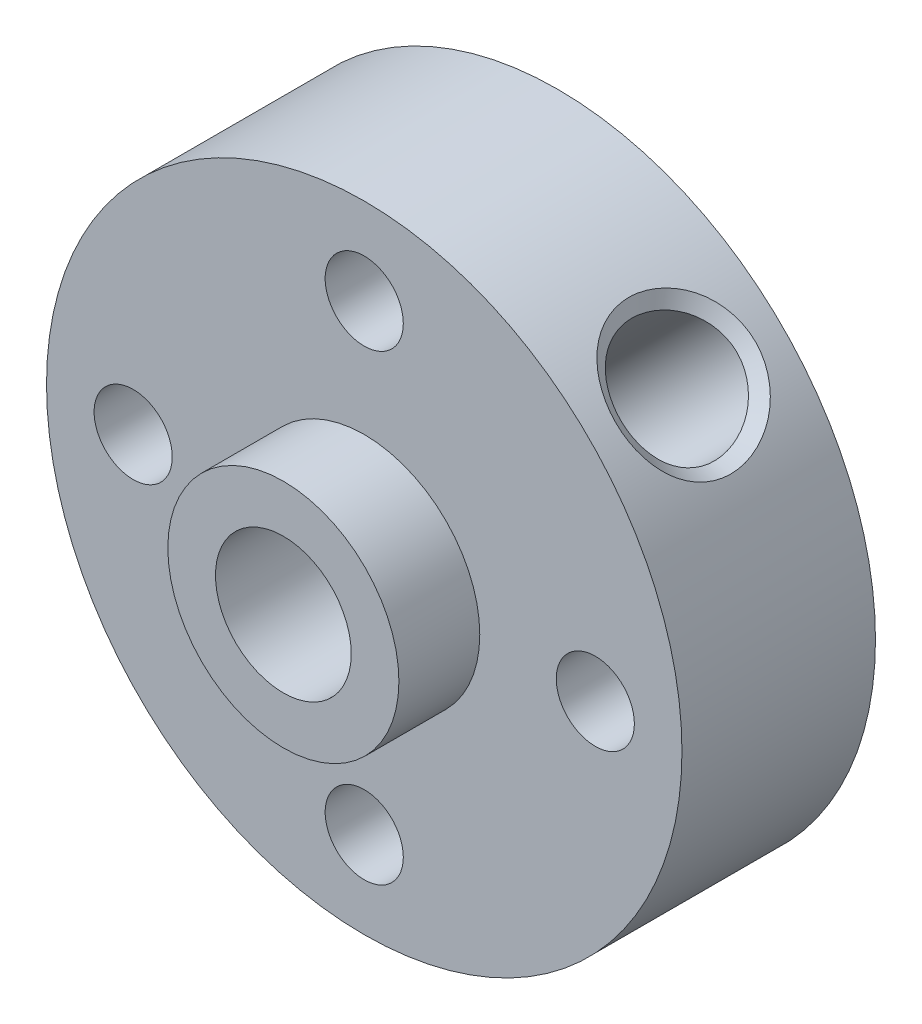
ISO-10303-21;
HEADER;
FILE_DESCRIPTION(('STEP AP214'),'2;1');
FILE_NAME('part.step','',(''),(''),'','','');
FILE_SCHEMA(('AUTOMOTIVE_DESIGN { 1 0 10303 214 1 1 1 1 }'));
ENDSEC;
DATA;
#1=APPLICATION_CONTEXT('core data for automotive mechanical design processes');
#2=APPLICATION_PROTOCOL_DEFINITION('international standard','automotive_design',2000,#1);
#3=PRODUCT_CONTEXT('',#1,'mechanical');
#4=PRODUCT('Part','Part','',(#3));
#5=PRODUCT_RELATED_PRODUCT_CATEGORY('part','',(#4));
#6=PRODUCT_DEFINITION_FORMATION('','',#4);
#7=PRODUCT_DEFINITION_CONTEXT('part definition',#1,'design');
#8=PRODUCT_DEFINITION('design','',#6,#7);
#9=PRODUCT_DEFINITION_SHAPE('','',#8);
#10=(LENGTH_UNIT() NAMED_UNIT(*) SI_UNIT(.MILLI.,.METRE.));
#11=(NAMED_UNIT(*) PLANE_ANGLE_UNIT() SI_UNIT($,.RADIAN.));
#12=(NAMED_UNIT(*) SI_UNIT($,.STERADIAN.) SOLID_ANGLE_UNIT());
#13=UNCERTAINTY_MEASURE_WITH_UNIT(LENGTH_MEASURE(1.E-05),#10,'distance_accuracy_value','');
#14=(GEOMETRIC_REPRESENTATION_CONTEXT(3) GLOBAL_UNCERTAINTY_ASSIGNED_CONTEXT((#13)) GLOBAL_UNIT_ASSIGNED_CONTEXT((#10,
#11,#12)) REPRESENTATION_CONTEXT('',''));
#15=CARTESIAN_POINT('',(0.,0.,0.));
#16=DIRECTION('',(0.,0.,1.));
#17=DIRECTION('',(1.,0.,0.));
#18=AXIS2_PLACEMENT_3D('',#15,#16,#17);
#19=CARTESIAN_POINT('',(0.,0.,3.35));
#20=DIRECTION('',(0.,0.,1.));
#21=DIRECTION('',(1.,0.,0.));
#22=AXIS2_PLACEMENT_3D('',#19,#20,#21);
#23=PLANE('',#22);
#24=CARTESIAN_POINT('',(0.,8.,3.35));
#25=DIRECTION('',(0.,0.,1.));
#26=DIRECTION('',(1.,0.,0.));
#27=AXIS2_PLACEMENT_3D('',#24,#25,#26);
#28=CIRCLE('',#27,1.35254999999999);
#29=CARTESIAN_POINT('',(1.35254999999999,8.,3.35));
#30=VERTEX_POINT('',#29);
#31=EDGE_CURVE('E161',#30,#30,#28,.T.);
#32=ORIENTED_EDGE('',*,*,#31,.F.);
#33=EDGE_LOOP('',(#32));
#34=FACE_BOUND('',#33,.T.);
#35=CARTESIAN_POINT('',(-8.,0.,3.35));
#36=DIRECTION('',(0.,0.,1.));
#37=DIRECTION('',(1.,0.,0.));
#38=AXIS2_PLACEMENT_3D('',#35,#36,#37);
#39=CIRCLE('',#38,1.35254999999999);
#40=CARTESIAN_POINT('',(-6.64745000000002,0.,3.35));
#41=VERTEX_POINT('',#40);
#42=EDGE_CURVE('E153',#41,#41,#39,.T.);
#43=ORIENTED_EDGE('',*,*,#42,.F.);
#44=EDGE_LOOP('',(#43));
#45=FACE_BOUND('',#44,.T.);
#46=CARTESIAN_POINT('',(8.,0.,3.35));
#47=DIRECTION('',(0.,0.,1.));
#48=DIRECTION('',(1.,0.,0.));
#49=AXIS2_PLACEMENT_3D('',#46,#47,#48);
#50=CIRCLE('',#49,1.35254999999999);
#51=CARTESIAN_POINT('',(9.35254999999998,0.,3.35));
#52=VERTEX_POINT('',#51);
#53=EDGE_CURVE('E148',#52,#52,#50,.T.);
#54=ORIENTED_EDGE('',*,*,#53,.F.);
#55=EDGE_LOOP('',(#54));
#56=FACE_BOUND('',#55,.T.);
#57=CARTESIAN_POINT('',(0.,-8.,3.35));
#58=DIRECTION('',(0.,0.,1.));
#59=DIRECTION('',(1.,0.,0.));
#60=AXIS2_PLACEMENT_3D('',#57,#58,#59);
#61=CIRCLE('',#60,1.35254999999999);
#62=CARTESIAN_POINT('',(1.35254999999999,-8.,3.35));
#63=VERTEX_POINT('',#62);
#64=EDGE_CURVE('E74',#63,#63,#61,.T.);
#65=ORIENTED_EDGE('',*,*,#64,.F.);
#66=EDGE_LOOP('',(#65));
#67=FACE_BOUND('',#66,.T.);
#68=CARTESIAN_POINT('',(0.,0.,3.35));
#69=DIRECTION('',(0.,0.,1.));
#70=DIRECTION('',(1.,0.,0.));
#71=AXIS2_PLACEMENT_3D('',#68,#69,#70);
#72=CIRCLE('',#71,11.);
#73=CARTESIAN_POINT('',(11.,0.,3.35));
#74=VERTEX_POINT('',#73);
#75=EDGE_CURVE('E35',#74,#74,#72,.T.);
#76=ORIENTED_EDGE('',*,*,#75,.T.);
#77=EDGE_LOOP('',(#76));
#78=FACE_BOUND('',#77,.T.);
#79=CARTESIAN_POINT('',(0.,0.,3.35));
#80=DIRECTION('',(0.,0.,1.));
#81=DIRECTION('',(1.,0.,0.));
#82=AXIS2_PLACEMENT_3D('',#79,#80,#81);
#83=CIRCLE('',#82,4.);
#84=CARTESIAN_POINT('',(4.,0.,3.35));
#85=VERTEX_POINT('',#84);
#86=EDGE_CURVE('E43',#85,#85,#83,.T.);
#87=ORIENTED_EDGE('',*,*,#86,.F.);
#88=EDGE_LOOP('',(#87));
#89=FACE_BOUND('',#88,.T.);
#90=ADVANCED_FACE('F13',(#34,#45,#56,#67,#78,#89),#23,.T.);
#91=CARTESIAN_POINT('',(0.,0.,-3.35));
#92=DIRECTION('',(0.,0.,1.));
#93=DIRECTION('',(1.,0.,0.));
#94=AXIS2_PLACEMENT_3D('',#91,#92,#93);
#95=CYLINDRICAL_SURFACE('',#94,11.);
#96=CARTESIAN_POINT('',(5.80850921114971,9.34137145948008,0.));
#97=CARTESIAN_POINT('',(5.80860175270186,9.34130684226353,0.637752239425175));
#98=CARTESIAN_POINT('',(6.04841944563921,9.19795689630476,1.26506432985481));
#99=CARTESIAN_POINT('',(6.80772994268232,8.65475782457621,2.15935304443139));
#100=CARTESIAN_POINT('',(7.31255506753503,8.24383991985221,2.42181611028021));
#101=CARTESIAN_POINT('',(8.24208780154511,7.31421539613682,2.42137394363942));
#102=CARTESIAN_POINT('',(8.65342910417239,6.80927509037896,2.16023058528546));
#103=CARTESIAN_POINT('',(9.19833006953286,6.04820111625002,1.26575073384544));
#104=CARTESIAN_POINT('',(9.34130756360717,5.80859981124356,0.640244269694805));
#105=CARTESIAN_POINT('',(9.34143535072447,5.80841861849954,-0.63996115444347));
#106=CARTESIAN_POINT('',(9.19862099961547,6.04773368941902,-1.26485137218771));
#107=CARTESIAN_POINT('',(8.65403117260026,6.8085025567722,-2.15966842361701));
#108=CARTESIAN_POINT('',(8.24214650834188,7.31418190369823,-2.42143639363605));
#109=CARTESIAN_POINT('',(7.31242801405934,8.24394174367863,-2.42175361413118));
#110=CARTESIAN_POINT('',(6.80825671047603,8.65433029295559,-2.15959971653594));
#111=CARTESIAN_POINT('',(6.04869975760828,9.19780320357039,-1.26576913530237));
#112=CARTESIAN_POINT('',(5.80841666959756,9.34143607669663,-0.637752239425176));
#113=CARTESIAN_POINT('',(5.80850921114971,9.34137145948008,0.));
#114=B_SPLINE_CURVE_WITH_KNOTS('',3,(#96,#97,#98,#99,#100,#101,#102,#103,#104,#105,#106,#107,
#108,#109,#110,#111,#112,#113),.UNSPECIFIED.,.T.,.F.,(4,2,2,2,2,2,2,2,4),(-3.18999496817969E-06,
0.00189587305523977,0.00379493610544773,0.00569399915565568,0.00759306220586364,
0.00949212525607159,0.0113911883062795,0.0132902513564875,0.0151893144066955),.UNSPECIFIED.);
#115=CARTESIAN_POINT('',(5.80850921114971,9.34137145948008,0.));
#116=VERTEX_POINT('',#115);
#117=EDGE_CURVE('E9',#116,#116,#114,.F.);
#118=ORIENTED_EDGE('',*,*,#117,.T.);
#119=EDGE_LOOP('',(#118));
#120=FACE_BOUND('',#119,.T.);
#121=CARTESIAN_POINT('',(0.,0.,-3.35));
#122=DIRECTION('',(0.,0.,1.));
#123=DIRECTION('',(1.,0.,0.));
#124=AXIS2_PLACEMENT_3D('',#121,#122,#123);
#125=CIRCLE('',#124,11.);
#126=CARTESIAN_POINT('',(11.,0.,-3.35));
#127=VERTEX_POINT('',#126);
#128=EDGE_CURVE('E30',#127,#127,#125,.T.);
#129=ORIENTED_EDGE('',*,*,#128,.T.);
#130=EDGE_LOOP('',(#129));
#131=FACE_BOUND('',#130,.T.);
#132=ORIENTED_EDGE('',*,*,#75,.F.);
#133=EDGE_LOOP('',(#132));
#134=FACE_BOUND('',#133,.T.);
#135=ADVANCED_FACE('F89',(#120,#131,#134),#95,.T.);
#136=CARTESIAN_POINT('',(0.,0.,-3.35));
#137=DIRECTION('',(0.,0.,1.));
#138=DIRECTION('',(1.,0.,0.));
#139=AXIS2_PLACEMENT_3D('',#136,#137,#138);
#140=PLANE('',#139);
#141=CARTESIAN_POINT('',(0.,8.,-3.35));
#142=DIRECTION('',(0.,0.,1.));
#143=DIRECTION('',(1.,0.,0.));
#144=AXIS2_PLACEMENT_3D('',#141,#142,#143);
#145=CIRCLE('',#144,1.35255);
#146=CARTESIAN_POINT('',(1.35255,8.,-3.35));
#147=VERTEX_POINT('',#146);
#148=EDGE_CURVE('E164',#147,#147,#145,.T.);
#149=ORIENTED_EDGE('',*,*,#148,.T.);
#150=EDGE_LOOP('',(#149));
#151=FACE_BOUND('',#150,.T.);
#152=CARTESIAN_POINT('',(-8.,0.,-3.35));
#153=DIRECTION('',(0.,0.,1.));
#154=DIRECTION('',(1.,0.,0.));
#155=AXIS2_PLACEMENT_3D('',#152,#153,#154);
#156=CIRCLE('',#155,1.35255);
#157=CARTESIAN_POINT('',(-6.64745,0.,-3.35));
#158=VERTEX_POINT('',#157);
#159=EDGE_CURVE('E158',#158,#158,#156,.T.);
#160=ORIENTED_EDGE('',*,*,#159,.T.);
#161=EDGE_LOOP('',(#160));
#162=FACE_BOUND('',#161,.T.);
#163=CARTESIAN_POINT('',(8.,0.,-3.35));
#164=DIRECTION('',(0.,0.,1.));
#165=DIRECTION('',(1.,0.,0.));
#166=AXIS2_PLACEMENT_3D('',#163,#164,#165);
#167=CIRCLE('',#166,1.35255);
#168=CARTESIAN_POINT('',(9.35255,0.,-3.35));
#169=VERTEX_POINT('',#168);
#170=EDGE_CURVE('E145',#169,#169,#167,.T.);
#171=ORIENTED_EDGE('',*,*,#170,.T.);
#172=EDGE_LOOP('',(#171));
#173=FACE_BOUND('',#172,.T.);
#174=CARTESIAN_POINT('',(0.,-8.,-3.35));
#175=DIRECTION('',(0.,0.,1.));
#176=DIRECTION('',(1.,0.,0.));
#177=AXIS2_PLACEMENT_3D('',#174,#175,#176);
#178=CIRCLE('',#177,1.35255);
#179=CARTESIAN_POINT('',(1.35255,-8.,-3.35));
#180=VERTEX_POINT('',#179);
#181=EDGE_CURVE('E150',#180,#180,#178,.T.);
#182=ORIENTED_EDGE('',*,*,#181,.T.);
#183=EDGE_LOOP('',(#182));
#184=FACE_BOUND('',#183,.T.);
#185=CARTESIAN_POINT('',(0.,0.,-3.35));
#186=DIRECTION('',(0.,0.,1.));
#187=DIRECTION('',(1.,0.,0.));
#188=AXIS2_PLACEMENT_3D('',#185,#186,#187);
#189=CIRCLE('',#188,2.35);
#190=CARTESIAN_POINT('',(2.35,0.,-3.35));
#191=VERTEX_POINT('',#190);
#192=EDGE_CURVE('E76',#191,#191,#189,.T.);
#193=ORIENTED_EDGE('',*,*,#192,.T.);
#194=EDGE_LOOP('',(#193));
#195=FACE_BOUND('',#194,.T.);
#196=ORIENTED_EDGE('',*,*,#128,.F.);
#197=EDGE_LOOP('',(#196));
#198=FACE_BOUND('',#197,.T.);
#199=ADVANCED_FACE('F96',(#151,#162,#173,#184,#195,#198),#140,.F.);
#200=CARTESIAN_POINT('',(0.,0.,6.15));
#201=DIRECTION('',(0.,0.,-1.));
#202=DIRECTION('',(-1.,0.,0.));
#203=AXIS2_PLACEMENT_3D('',#200,#201,#202);
#204=CYLINDRICAL_SURFACE('',#203,4.);
#205=CARTESIAN_POINT('',(0.,0.,6.15));
#206=DIRECTION('',(0.,0.,1.));
#207=DIRECTION('',(1.,0.,0.));
#208=AXIS2_PLACEMENT_3D('',#205,#206,#207);
#209=CIRCLE('',#208,4.);
#210=CARTESIAN_POINT('',(4.,0.,6.15));
#211=VERTEX_POINT('',#210);
#212=EDGE_CURVE('E40',#211,#211,#209,.T.);
#213=ORIENTED_EDGE('',*,*,#212,.F.);
#214=EDGE_LOOP('',(#213));
#215=FACE_BOUND('',#214,.T.);
#216=ORIENTED_EDGE('',*,*,#86,.T.);
#217=EDGE_LOOP('',(#216));
#218=FACE_BOUND('',#217,.T.);
#219=ADVANCED_FACE('F86',(#215,#218),#204,.T.);
#220=CARTESIAN_POINT('',(0.,0.,6.15));
#221=DIRECTION('',(0.,0.,1.));
#222=DIRECTION('',(1.,0.,0.));
#223=AXIS2_PLACEMENT_3D('',#220,#221,#222);
#224=PLANE('',#223);
#225=CARTESIAN_POINT('',(0.,0.,6.15));
#226=DIRECTION('',(0.,0.,1.));
#227=DIRECTION('',(1.,0.,0.));
#228=AXIS2_PLACEMENT_3D('',#225,#226,#227);
#229=CIRCLE('',#228,2.35);
#230=CARTESIAN_POINT('',(2.35,0.,6.15));
#231=VERTEX_POINT('',#230);
#232=EDGE_CURVE('E73',#231,#231,#229,.T.);
#233=ORIENTED_EDGE('',*,*,#232,.F.);
#234=EDGE_LOOP('',(#233));
#235=FACE_BOUND('',#234,.T.);
#236=ORIENTED_EDGE('',*,*,#212,.T.);
#237=EDGE_LOOP('',(#236));
#238=FACE_BOUND('',#237,.T.);
#239=ADVANCED_FACE('F179',(#235,#238),#224,.T.);
#240=CARTESIAN_POINT('',(0.,0.,-3.35));
#241=DIRECTION('',(0.,0.,1.));
#242=DIRECTION('',(1.,0.,0.));
#243=AXIS2_PLACEMENT_3D('',#240,#241,#242);
#244=CYLINDRICAL_SURFACE('',#243,2.35);
#245=CARTESIAN_POINT('',(2.35,0.,-1.14731098225371));
#246=CARTESIAN_POINT('',(2.34999865755423,0.0942371783838506,-1.24382887112498));
#247=CARTESIAN_POINT('',(2.34429963133438,0.194530010151852,-1.33451238244948));
#248=CARTESIAN_POINT('',(2.31751011608541,0.403408000777201,-1.50322673189012));
#249=CARTESIAN_POINT('',(2.29643198522455,0.511986438888964,-1.58126766768962));
#250=CARTESIAN_POINT('',(2.24212159352828,0.70955509594591,-1.70654718636632));
#251=CARTESIAN_POINT('',(2.21255655474779,0.797634740580869,-1.75678942125637));
#252=CARTESIAN_POINT('',(2.14059776087362,0.974383186895158,-1.84587035496611));
#253=CARTESIAN_POINT('',(2.09821346658543,1.06305150708308,-1.88471742208519));
#254=CARTESIAN_POINT('',(1.99951048680062,1.2388301231087,-1.94904910728143));
#255=CARTESIAN_POINT('',(1.94306111671741,1.32591708594206,-1.9744009830331));
#256=CARTESIAN_POINT('',(1.81722396837134,1.49370277830244,-2.00904783957737));
#257=CARTESIAN_POINT('',(1.74785070622988,1.57440853174146,-2.01836071631529));
#258=CARTESIAN_POINT('',(1.61008203678825,1.71413809330388,-2.01997250416941));
#259=CARTESIAN_POINT('',(1.54314669487548,1.77459208852907,-2.01464652870547));
#260=CARTESIAN_POINT('',(1.4040149325109,1.88658782271947,-1.99226985493216));
#261=CARTESIAN_POINT('',(1.33181848024783,1.93812950779007,-1.97521908572362));
#262=CARTESIAN_POINT('',(1.18620219389568,2.03044392135117,-1.93096083550066));
#263=CARTESIAN_POINT('',(1.11284470549007,2.07142956160108,-1.90398626290133));
#264=CARTESIAN_POINT('',(0.965384730916321,2.14413237246923,-1.84116992423952));
#265=CARTESIAN_POINT('',(0.89128194863842,2.17584569546474,-1.80532448850055));
#266=CARTESIAN_POINT('',(0.711923023415218,2.24239926165191,-1.70883566026604));
#267=CARTESIAN_POINT('',(0.607103940117388,2.27262325642808,-1.64418164115478));
#268=CARTESIAN_POINT('',(0.402693482703603,2.31761741188104,-1.50232488162295));
#269=CARTESIAN_POINT('',(0.303115193327943,2.33235048763864,-1.42509253663529));
#270=CARTESIAN_POINT('',(0.110278978074116,2.34943409764441,-1.25832255186843));
#271=CARTESIAN_POINT('',(0.0171786572793091,2.3515420361751,-1.16857754009238));
#272=CARTESIAN_POINT('',(-0.113268174318536,2.34767435978373,-1.02595823581702));
#273=CARTESIAN_POINT('',(-0.155208291823175,2.3452148510663,-0.977096469570982));
#274=CARTESIAN_POINT('',(-0.235364095856103,2.33852865394441,-0.876534850919809));
#275=CARTESIAN_POINT('',(-0.273581592193133,2.33430282960193,-0.82483639691858));
#276=CARTESIAN_POINT('',(-0.352135664707755,2.32386445482446,-0.708360039910352));
#277=CARTESIAN_POINT('',(-0.391520027258933,2.31742776256928,-0.642950348350569));
#278=CARTESIAN_POINT('',(-0.461310932635261,2.3045500987841,-0.507494869286966));
#279=CARTESIAN_POINT('',(-0.491732840325683,2.29810915377501,-0.437457271109714));
#280=CARTESIAN_POINT('',(-0.535710020218182,2.28821601932067,-0.306373093332155));
#281=CARTESIAN_POINT('',(-0.551347635149519,2.28443100652986,-0.24606993223966));
#282=CARTESIAN_POINT('',(-0.572440520023014,2.27924077690687,-0.123645832643517));
#283=CARTESIAN_POINT('',(-0.577916086640678,2.27783081689957,-0.0615287697956371));
#284=CARTESIAN_POINT('',(-0.577847597854973,2.27784809018867,0.0628487100902878));
#285=CARTESIAN_POINT('',(-0.572277129918015,2.27928212385215,0.125109114308252));
#286=CARTESIAN_POINT('',(-0.550959357263952,2.28452547104752,0.247791447531881));
#287=CARTESIAN_POINT('',(-0.535191976879272,2.28833946973026,0.308209503075632));
#288=CARTESIAN_POINT('',(-0.486093219693653,2.29936759345526,0.453824007962764));
#289=CARTESIAN_POINT('',(-0.447989381908881,2.307337238692,0.53731531473635));
#290=CARTESIAN_POINT('',(-0.359721658794893,2.32273866809104,0.697806882914051));
#291=CARTESIAN_POINT('',(-0.309510938555147,2.33016821396811,0.774780328322042));
#292=CARTESIAN_POINT('',(-0.21185976572082,2.34083732281048,0.907537205551385));
#293=CARTESIAN_POINT('',(-0.165963172460694,2.34462371200927,0.964428815336687));
#294=CARTESIAN_POINT('',(-0.0699464791237551,2.34945198537864,1.07466711090831));
#295=CARTESIAN_POINT('',(-0.0198240710368395,2.35049235960774,1.1280118306714));
#296=CARTESIAN_POINT('',(0.135571780847402,2.34836268794325,1.28277575291077));
#297=CARTESIAN_POINT('',(0.246026885330559,2.33996326687445,1.37912377471826));
#298=CARTESIAN_POINT('',(0.453275256945365,2.30777517367926,1.53907185458161));
#299=CARTESIAN_POINT('',(0.548505248073985,2.28732405003261,1.60538958815303));
#300=CARTESIAN_POINT('',(0.742272414486463,2.23195611477239,1.72607794149473));
#301=CARTESIAN_POINT('',(0.84080325692504,2.19706569180868,1.78047007999197));
#302=CARTESIAN_POINT('',(1.01881982225309,2.1194411327215,1.86543295500437));
#303=CARTESIAN_POINT('',(1.09830176451924,2.07953090155067,1.8985765389521));
#304=CARTESIAN_POINT('',(1.25499767737792,1.98888178167416,1.95362844871844));
#305=CARTESIAN_POINT('',(1.33221295846061,1.93814929604201,1.97554339208295));
#306=CARTESIAN_POINT('',(1.48208488766445,1.8261205932933,2.00680097906864));
#307=CARTESIAN_POINT('',(1.55471480031334,1.76476905805341,2.01607540863556));
#308=CARTESIAN_POINT('',(1.69219264492599,1.63340575288017,2.0211078984876));
#309=CARTESIAN_POINT('',(1.75704228835065,1.56339589446392,2.0168689370518));
#310=CARTESIAN_POINT('',(1.87162995326466,1.42371015972056,1.99617875526323));
#311=CARTESIAN_POINT('',(1.92219336830151,1.35453990914408,1.98082729643269));
#312=CARTESIAN_POINT('',(2.01434197893694,1.21327812604939,1.9400905070543));
#313=CARTESIAN_POINT('',(2.05592567330612,1.14118610745907,1.91470350076896));
#314=CARTESIAN_POINT('',(2.13239389453108,0.991419480542548,1.85323208620832));
#315=CARTESIAN_POINT('',(2.16668318506632,0.913681717962815,1.81656941185815));
#316=CARTESIAN_POINT('',(2.22558931874965,0.759023358029464,1.73480588197626));
#317=CARTESIAN_POINT('',(2.25020018068542,0.68210329448502,1.6896998338203));
#318=CARTESIAN_POINT('',(2.3008045419391,0.492582219430117,1.56794931325831));
#319=CARTESIAN_POINT('',(2.32132701471041,0.381387852079403,1.48681777078989));
#320=CARTESIAN_POINT('',(2.34646867057981,0.167869438525509,1.31123710503856));
#321=CARTESIAN_POINT('',(2.35104441848579,0.0655703578824166,1.21675233694511));
#322=CARTESIAN_POINT('',(2.34875435584492,-0.11151719716945,1.03037179691632));
#323=CARTESIAN_POINT('',(2.34349758964539,-0.188131852033529,0.940202768101616));
#324=CARTESIAN_POINT('',(2.33199154484218,-0.29249401900303,0.797699862096518));
#325=CARTESIAN_POINT('',(2.32755880827864,-0.325494328853524,0.749041746039511));
#326=CARTESIAN_POINT('',(2.31810600251381,-0.387105474918278,0.649096344106237));
#327=CARTESIAN_POINT('',(2.31308639332248,-0.415719708957989,0.597811134915402));
#328=CARTESIAN_POINT('',(2.30255860896732,-0.470752525313548,0.48556006815664));
#329=CARTESIAN_POINT('',(2.29707200701324,-0.496399081637669,0.424203591869071));
#330=CARTESIAN_POINT('',(2.28764419809267,-0.538191310083058,0.298282899855328));
#331=CARTESIAN_POINT('',(2.28369897129785,-0.554361751311269,0.233727529493434));
#332=CARTESIAN_POINT('',(2.27858412601789,-0.575051050122202,0.101815293041823));
#333=CARTESIAN_POINT('',(2.27744615008759,-0.579437126284574,0.0344351192555267));
#334=CARTESIAN_POINT('',(2.27848777189935,-0.575320897191948,-0.0999234712986263));
#335=CARTESIAN_POINT('',(2.2806698320151,-0.566809025925486,-0.166901552849426));
#336=CARTESIAN_POINT('',(2.28804680712479,-0.536290604673907,-0.308119142042082));
#337=CARTESIAN_POINT('',(2.29364836785233,-0.512433671252812,-0.381919897380558));
#338=CARTESIAN_POINT('',(2.30601762888701,-0.453523199472328,-0.524838725370065));
#339=CARTESIAN_POINT('',(2.31278897059062,-0.418434397612026,-0.593941207637752));
#340=CARTESIAN_POINT('',(2.32767592913537,-0.327386018935672,-0.749488411050103));
#341=CARTESIAN_POINT('',(2.3354988652508,-0.26835944977429,-0.834140828400574));
#342=CARTESIAN_POINT('',(2.3466626258595,-0.140741764386813,-0.996108331221937));
#343=CARTESIAN_POINT('',(2.35000102774111,-0.0721455005381346,-1.07341942986514));
#344=CARTESIAN_POINT('',(2.35,0.,-1.14731098225371));
#345=B_SPLINE_CURVE_WITH_KNOTS('',3,(#245,#246,#247,#248,#249,#250,#251,#252,#253,#254,#255,
#256,#257,#258,#259,#260,#261,#262,#263,#264,#265,#266,#267,#268,#269,#270,#271,#272,#273,#274,
#275,#276,#277,#278,#279,#280,#281,#282,#283,#284,#285,#286,#287,#288,#289,#290,#291,#292,#293,
#294,#295,#296,#297,#298,#299,#300,#301,#302,#303,#304,#305,#306,#307,#308,#309,#310,#311,#312,
#313,#314,#315,#316,#317,#318,#319,#320,#321,#322,#323,#324,#325,#326,#327,#328,#329,#330,#331,
#332,#333,#334,#335,#336,#337,#338,#339,#340,#341,#342,#343,#344),.UNSPECIFIED.,.T.,.F.,(4,2,2,
2,2,2,2,2,2,2,2,2,2,2,2,2,2,2,2,2,2,2,2,2,2,2,2,2,2,2,2,2,2,2,2,2,2,2,2,2,2,2,2,2,2,2,2,2,2,4),
(0.,0.404394394557686,0.808464187799712,1.12414589469793,1.43959518984298,1.75809253051429,
2.07623426840618,2.34592523373674,2.61561782988791,2.87934731973484,3.14318609144331,
3.52153021009275,3.90077802818248,4.28729040743778,4.48046159166384,4.67353838908616,
4.90291112543558,5.13188831523765,5.31837351649852,5.50448584804634,5.69104373549324,
5.87797004065671,6.15277878906255,6.42866817689628,6.64797456162453,6.86740151047553,
7.3055079168821,7.65777869611101,8.00940850350243,8.29300172341822,8.57642761621966,
8.86137702956299,9.14626364592208,9.40625051916103,9.66628082340438,9.94286997732365,
10.2196297941173,10.6348842056131,11.0512687939164,11.4053707977036,11.5820767626017,
11.7586451366321,11.9582225196581,12.1572758840613,12.3585628754133,12.5599992282321,
12.7919772955285,13.0246909433049,13.3341175459386,13.6437112382639),.UNSPECIFIED.);
#346=CARTESIAN_POINT('',(2.35,0.,-1.14731098225371));
#347=VERTEX_POINT('',#346);
#348=EDGE_CURVE('E67',#347,#347,#345,.T.);
#349=ORIENTED_EDGE('',*,*,#348,.T.);
#350=EDGE_LOOP('',(#349));
#351=FACE_BOUND('',#350,.T.);
#352=ORIENTED_EDGE('',*,*,#192,.F.);
#353=EDGE_LOOP('',(#352));
#354=FACE_BOUND('',#353,.T.);
#355=ORIENTED_EDGE('',*,*,#232,.T.);
#356=EDGE_LOOP('',(#355));
#357=FACE_BOUND('',#356,.T.);
#358=ADVANCED_FACE('F61',(#351,#354,#357),#244,.F.);
#359=CARTESIAN_POINT('',(7.77817459305204,7.77817459305201,0.));
#360=DIRECTION('',(0.707106781186549,0.707106781186546,0.));
#361=DIRECTION('',(-0.707106781186546,0.707106781186549,0.));
#362=AXIS2_PLACEMENT_3D('',#359,#360,#361);
#363=CYLINDRICAL_SURFACE('',#362,2.0193);
#364=CARTESIAN_POINT('',(5.91506401697902,8.77078546347898,0.));
#365=CARTESIAN_POINT('',(5.91505848231522,8.77078895441069,-0.0332110676749004));
#366=CARTESIAN_POINT('',(5.91584250371787,8.77036908136088,-0.0664205027333986));
#367=CARTESIAN_POINT('',(5.91894801804012,8.76868447204241,-0.132706000824386));
#368=CARTESIAN_POINT('',(5.9212676546673,8.76742075581778,-0.1657821764358));
#369=CARTESIAN_POINT('',(5.92740096477233,8.76405141279833,-0.231730396913027));
#370=CARTESIAN_POINT('',(5.93121367555311,8.76194632847871,-0.264602559475331));
#371=CARTESIAN_POINT('',(5.94028892447994,8.75689761117119,-0.33007339450581));
#372=CARTESIAN_POINT('',(5.94555114052323,8.7539541644756,-0.362672126078199));
#373=CARTESIAN_POINT('',(5.95748172497235,8.74723181556498,-0.427526437618047));
#374=CARTESIAN_POINT('',(5.96415019887331,8.74345285066973,-0.459781991650091));
#375=CARTESIAN_POINT('',(5.97884975539384,8.73506249034033,-0.523880394046922));
#376=CARTESIAN_POINT('',(5.98688119889341,8.73045087442044,-0.55572313069829));
#377=CARTESIAN_POINT('',(6.00426333819006,8.72039813550142,-0.618926309415735));
#378=CARTESIAN_POINT('',(6.01361451659092,8.71495670899629,-0.650286570375663));
#379=CARTESIAN_POINT('',(6.03359289306655,8.70324720139476,-0.712455190591759));
#380=CARTESIAN_POINT('',(6.04422059736454,8.69697879224988,-0.743263325292281));
#381=CARTESIAN_POINT('',(6.06670888670971,8.68361811087547,-0.804258051751252));
#382=CARTESIAN_POINT('',(6.07856993563723,8.67652552854269,-0.83444440449617));
#383=CARTESIAN_POINT('',(6.10348184418441,8.66151925847353,-0.894125891486485));
#384=CARTESIAN_POINT('',(6.1165330880074,8.65360530547822,-0.92362079863844));
#385=CARTESIAN_POINT('',(6.14378232701951,8.63695899466251,-0.981849692064879));
#386=CARTESIAN_POINT('',(6.15798061459986,8.62822642807899,-1.01058348182968));
#387=CARTESIAN_POINT('',(6.18748098358667,8.60994569245589,-1.0672204054046));
#388=CARTESIAN_POINT('',(6.20278327541986,8.60039736786602,-1.09512337941919));
#389=CARTESIAN_POINT('',(6.23444834486617,8.58048749877547,-1.15002897367341));
#390=CARTESIAN_POINT('',(6.25081127954806,8.57012583378044,-1.17703145966051));
#391=CARTESIAN_POINT('',(6.28455556770699,8.54859326407029,-1.23006622575013));
#392=CARTESIAN_POINT('',(6.30193706947596,8.53742224146554,-1.25609836367373));
#393=CARTESIAN_POINT('',(6.33767164204864,8.51426907303072,-1.30712323462615));
#394=CARTESIAN_POINT('',(6.35602490834892,8.50228676385234,-1.33211575668861));
#395=CARTESIAN_POINT('',(6.39367379710448,8.47753119815555,-1.38098995191832));
#396=CARTESIAN_POINT('',(6.41296973283744,8.46475767831074,-1.40487125057306));
#397=CARTESIAN_POINT('',(6.45239380966425,8.43836765389058,-1.45144277207452));
#398=CARTESIAN_POINT('',(6.47252179241438,8.42475130946692,-1.47413321969915));
#399=CARTESIAN_POINT('',(6.51347588006849,8.39664993352501,-1.51827896365429));
#400=CARTESIAN_POINT('',(6.53430150189429,8.38216549784592,-1.53973508781516));
#401=CARTESIAN_POINT('',(6.57659692078657,8.35237560191873,-1.58137915482344));
#402=CARTESIAN_POINT('',(6.59806639414692,8.33707055129587,-1.60156771966927));
#403=CARTESIAN_POINT('',(6.64157796071986,8.30566497179513,-1.64064582304461));
#404=CARTESIAN_POINT('',(6.66361982921346,8.28956475292207,-1.65953586105512));
#405=CARTESIAN_POINT('',(6.70820943365554,8.25660020779171,-1.69598536565465));
#406=CARTESIAN_POINT('',(6.73075699607695,8.23973614168033,-1.71354527988382));
#407=CARTESIAN_POINT('',(6.77629000761416,8.20527364445819,-1.74730308237523));
#408=CARTESIAN_POINT('',(6.7992753094278,8.18767545809095,-1.76350141922007));
#409=CARTESIAN_POINT('',(6.84561618019306,8.15177485327989,-1.79450451369917));
#410=CARTESIAN_POINT('',(6.86897161775489,8.13347268158226,-1.80930975345407));
#411=CARTESIAN_POINT('',(6.915985056941,8.09619410943874,-1.8374950782937));
#412=CARTESIAN_POINT('',(6.93964294335846,8.07721796109372,-1.8508756889275));
#413=CARTESIAN_POINT('',(6.98719359976604,8.03862146663375,-1.87618016635322));
#414=CARTESIAN_POINT('',(7.01108627669855,8.01900136905856,-1.88810458698167));
#415=CARTESIAN_POINT('',(7.05903882080187,7.97914700798319,-1.91046511062841));
#416=CARTESIAN_POINT('',(7.08309862402777,7.95891297037338,-1.92090175318898));
#417=CARTESIAN_POINT('',(7.13131772267692,7.91786078233943,-1.94025519102211));
#418=CARTESIAN_POINT('',(7.15547698625861,7.89704280807245,-1.94917243903047));
#419=CARTESIAN_POINT('',(7.20382730656836,7.85485282469413,-1.96545562647138));
#420=CARTESIAN_POINT('',(7.2280183572575,7.83348090947038,-1.97282182688519));
#421=CARTESIAN_POINT('',(7.27636455934795,7.7902131575659,-1.9859715835014));
#422=CARTESIAN_POINT('',(7.30051970910261,7.76831729759627,-1.99175506921085));
#423=CARTESIAN_POINT('',(7.34872645183661,7.72403178920513,-2.0017081311534));
#424=CARTESIAN_POINT('',(7.37277800466266,7.70164196687641,-2.00587712907822));
#425=CARTESIAN_POINT('',(7.42070990754527,7.65639875033492,-2.01257039611203));
#426=CARTESIAN_POINT('',(7.4445901076154,7.63354500443549,-2.01509336544913));
#427=CARTESIAN_POINT('',(7.49211187188735,7.58740398851408,-2.01846297530972));
#428=CARTESIAN_POINT('',(7.51575306944566,7.56411617370423,-2.01930734284276));
#429=CARTESIAN_POINT('',(7.56268537381162,7.51718143523516,-2.01929214610317));
#430=CARTESIAN_POINT('',(7.58597640723568,7.49353443833365,-2.01843222954557));
#431=CARTESIAN_POINT('',(7.63213269087667,7.44599278654125,-2.01503739250119));
#432=CARTESIAN_POINT('',(7.65499833438957,7.42209839582681,-2.01250410727608));
#433=CARTESIAN_POINT('',(7.70027314745174,7.37413068840908,-2.00579376995032));
#434=CARTESIAN_POINT('',(7.7226825250674,7.35005746041974,-2.00161748558656));
#435=CARTESIAN_POINT('',(7.76701398076268,7.30180085174934,-1.99165308065753));
#436=CARTESIAN_POINT('',(7.78893610238858,7.27761748114641,-1.98586510476038));
#437=CARTESIAN_POINT('',(7.83226222533887,7.22920923113277,-1.97270874422235));
#438=CARTESIAN_POINT('',(7.85366613690357,7.20498434529831,-1.96534008793903));
#439=CARTESIAN_POINT('',(7.89592497299628,7.15656166922531,-1.94905366064103));
#440=CARTESIAN_POINT('',(7.91677971060388,7.13236389082919,-1.94013536983414));
#441=CARTESIAN_POINT('',(7.95790929380116,7.08406400516905,-1.92078078423956));
#442=CARTESIAN_POINT('',(7.97818389178886,7.05996194242695,-1.91034385253155));
#443=CARTESIAN_POINT('',(8.01812224950334,7.0119220569662,-1.88798297317344));
#444=CARTESIAN_POINT('',(8.03778573410585,6.98798431189647,-1.87605836754498));
#445=CARTESIAN_POINT('',(8.07647088550343,6.94034163726295,-1.85075303378894));
#446=CARTESIAN_POINT('',(8.09549227656628,6.91663681074191,-1.83737169026327));
#447=CARTESIAN_POINT('',(8.13286222382865,6.86952855499725,-1.80918371284058));
#448=CARTESIAN_POINT('',(8.15121052192307,6.84612524357942,-1.79437653992198));
#449=CARTESIAN_POINT('',(8.18720327904014,6.79968863480247,-1.76336770394078));
#450=CARTESIAN_POINT('',(8.20484750501893,6.7766554614392,-1.74716558467095));
#451=CARTESIAN_POINT('',(8.23940098478744,6.7310276756681,-1.71339764848219));
#452=CARTESIAN_POINT('',(8.25631002512714,6.70843319166702,-1.69583143959049));
#453=CARTESIAN_POINT('',(8.28936245658593,6.66375163283351,-1.65936614329798));
#454=CARTESIAN_POINT('',(8.30550563361526,6.64166470076171,-1.64046668682979));
#455=CARTESIAN_POINT('',(8.33699399859717,6.59806596681263,-1.6013657262551));
#456=CARTESIAN_POINT('',(8.35233893380897,6.57655434812706,-1.5811638142422));
#457=CARTESIAN_POINT('',(8.38220479917345,6.53417810328665,-1.53948894405403));
#458=CARTESIAN_POINT('',(8.39672538327565,6.51331375048719,-1.51801545970707));
#459=CARTESIAN_POINT('',(8.42489311596827,6.47228827852071,-1.47382811571226));
#460=CARTESIAN_POINT('',(8.43853973376537,6.45212759003506,-1.45111351751843));
#461=CARTESIAN_POINT('',(8.46498311220624,6.41264578919865,-1.40450223516731));
#462=CARTESIAN_POINT('',(8.47778006619723,6.3933244861879,-1.38060582211521));
#463=CARTESIAN_POINT('',(8.50257514167933,6.35563320480253,-1.33172197410269));
#464=CARTESIAN_POINT('',(8.51457408105178,6.33726225684296,-1.30673570103524));
#465=CARTESIAN_POINT('',(8.53775286994541,6.30150132680001,-1.25573829303498));
#466=CARTESIAN_POINT('',(8.54893337535543,6.28411056183229,-1.22972800503158));
#467=CARTESIAN_POINT('',(8.57047851389438,6.25035520776226,-1.17674891016928));
#468=CARTESIAN_POINT('',(8.58084366898023,6.23398996354729,-1.14978073283482));
#469=CARTESIAN_POINT('',(8.60075497666372,6.20232675855256,-1.09495202742265));
#470=CARTESIAN_POINT('',(8.61030156068652,6.1870282363647,-1.06709198016873));
#471=CARTESIAN_POINT('',(8.62857424193247,6.15754073429503,-1.01054566085374));
#472=CARTESIAN_POINT('',(8.63730070526261,6.14335125980824,-0.981859764999466));
#473=CARTESIAN_POINT('',(8.65393118322941,6.1161238432409,-0.923727827713145));
#474=CARTESIAN_POINT('',(8.66183551201454,6.10308546160268,-0.894282082037689));
#475=CARTESIAN_POINT('',(8.67681986647412,6.07820231388729,-0.834696503956037));
#476=CARTESIAN_POINT('',(8.68390015394207,6.06635716888694,-0.804556895651188));
#477=CARTESIAN_POINT('',(8.69723453927416,6.04390255145559,-0.743649643103451));
#478=CARTESIAN_POINT('',(8.70348883246058,6.03329278696553,-0.712882149330108));
#479=CARTESIAN_POINT('',(8.71516936551009,6.01335096704361,-0.650785178799454));
#480=CARTESIAN_POINT('',(8.72059570606082,6.00401875626216,-0.619455770895432));
#481=CARTESIAN_POINT('',(8.73061849592327,5.98667402839745,-0.556301032430907));
#482=CARTESIAN_POINT('',(8.73521490889623,5.97866156910146,-0.524475680221503));
#483=CARTESIAN_POINT('',(8.74357604893017,5.96399825071929,-0.460395119679618));
#484=CARTESIAN_POINT('',(8.74734054591038,5.95734776834859,-0.428139795039586));
#485=CARTESIAN_POINT('',(8.75403611517924,5.94545020513707,-0.363265361084163));
#486=CARTESIAN_POINT('',(8.75696669272248,5.94020395750587,-0.330646047697543));
#487=CARTESIAN_POINT('',(8.76199275794243,5.93115651464901,-0.26510968430049));
#488=CARTESIAN_POINT('',(8.76408740155928,5.92735678017528,-0.232192367504747));
#489=CARTESIAN_POINT('',(8.76744000846943,5.9212438787935,-0.166126063866233));
#490=CARTESIAN_POINT('',(8.768696681024,5.91893300538347,-0.132976798738427));
#491=CARTESIAN_POINT('',(8.77037188909036,5.91583898922573,-0.0665124282631925));
#492=CARTESIAN_POINT('',(8.77078857901006,5.91505921066461,-0.0331971186146473));
#493=CARTESIAN_POINT('',(8.77078234422555,5.91506882985746,0.0334354198008934));
#494=CARTESIAN_POINT('',(8.77035936358662,5.91585833214922,0.0667526485478866));
#495=CARTESIAN_POINT('',(8.76867146473502,5.91897238819308,0.133224296589024));
#496=CARTESIAN_POINT('',(8.7674082887969,5.9212937652881,0.166378910068233));
#497=CARTESIAN_POINT('',(8.76404262761879,5.92742794695482,0.232458795725585));
#498=CARTESIAN_POINT('',(8.76194134378471,5.93123861650763,0.26538432784209));
#499=CARTESIAN_POINT('',(8.75690192757778,5.94030819641757,0.330939444120571));
#500=CARTESIAN_POINT('',(8.75396456516733,5.94556577413947,0.363569272205732));
#501=CARTESIAN_POINT('',(8.74725535386681,5.95748617552347,0.428466492217271));
#502=CARTESIAN_POINT('',(8.74348394143915,5.96414826411337,0.460734064467776));
#503=CARTESIAN_POINT('',(8.73510889001523,5.97883490576693,0.524840307220213));
#504=CARTESIAN_POINT('',(8.7305054388406,5.98685915131708,0.556679072780168));
#505=CARTESIAN_POINT('',(8.72046848535582,6.00422748816641,0.619861251959672));
#506=CARTESIAN_POINT('',(8.71503499303039,6.01357156358903,0.651204671532821));
#507=CARTESIAN_POINT('',(8.70334006221748,6.03353707477466,0.71332970334266));
#508=CARTESIAN_POINT('',(8.69707851221822,6.04415868256127,0.744111239275851));
#509=CARTESIAN_POINT('',(8.68372951263669,6.06663687147066,0.805046035453226));
#510=CARTESIAN_POINT('',(8.67664187185277,6.0784937384309,0.835199148335344));
#511=CARTESIAN_POINT('',(8.66164270405434,6.10340013586137,0.894810613656911));
#512=CARTESIAN_POINT('',(8.65373093354436,6.11645001867717,0.924268757591389));
#513=CARTESIAN_POINT('',(8.63708546101235,6.1437001608459,0.982423787635077));
#514=CARTESIAN_POINT('',(8.62835147637858,6.1579008155074,1.01112040761647));
#515=CARTESIAN_POINT('',(8.61006363456532,6.18741031938702,1.0676858834715));
#516=CARTESIAN_POINT('',(8.60050945492705,6.20271960408834,1.09555440793038));
#517=CARTESIAN_POINT('',(8.58058284492023,6.23440387837896,1.15039720437352));
#518=CARTESIAN_POINT('',(8.57021003759893,6.25077935830365,1.17737105617333));
#519=CARTESIAN_POINT('',(8.54864944445045,6.2845546751928,1.23035799961978));
#520=CARTESIAN_POINT('',(8.53746120026439,6.30195508720328,1.25637053833628));
#521=CARTESIAN_POINT('',(8.5142669232988,6.33773457120861,1.30736855221933));
#522=CARTESIAN_POINT('',(8.50226030619904,6.3561143403794,1.33235327267238));
#523=CARTESIAN_POINT('',(8.47744934140315,6.39382294388809,1.38122882200797));
#524=CARTESIAN_POINT('',(8.46464425050446,6.4131526587608,1.40511859474889));
#525=CARTESIAN_POINT('',(8.43818660196548,6.4526481078882,1.45171251711371));
#526=CARTESIAN_POINT('',(8.42453397317265,6.472813912287,1.47441656689831));
#527=CARTESIAN_POINT('',(8.39635830986087,6.51384425532208,1.51858066920913));
#528=CARTESIAN_POINT('',(8.38183596066717,6.53470823823056,1.5400416756681));
#529=CARTESIAN_POINT('',(8.351969724349,6.57707948460711,1.58168918955006));
#530=CARTESIAN_POINT('',(8.33662631249607,6.59858637281448,1.60187641986011));
#531=CARTESIAN_POINT('',(8.30514387938478,6.6421718620316,1.64094629790072));
#532=CARTESIAN_POINT('',(8.28900521800497,6.66425020233021,1.65982952661447));
#533=CARTESIAN_POINT('',(8.25596425137547,6.7089114379051,1.69626108459567));
#534=CARTESIAN_POINT('',(8.23906224475768,6.73149413415179,1.71380992880571));
#535=CARTESIAN_POINT('',(8.20452486185037,6.77709580693246,1.74754235960537));
#536=CARTESIAN_POINT('',(8.1868897618932,6.80011461732841,1.76372645378098));
#537=CARTESIAN_POINT('',(8.15091686836598,6.84652057975221,1.79469895545694));
#538=CARTESIAN_POINT('',(8.13257935010047,6.8699075853957,1.80948790205611));
#539=CARTESIAN_POINT('',(8.09523215855355,6.91698192631167,1.83763964193117));
#540=CARTESIAN_POINT('',(8.07622276636989,6.94066913338688,1.85100302244686));
#541=CARTESIAN_POINT('',(8.03756239098397,6.98827588717757,1.87627314501539));
#542=CARTESIAN_POINT('',(8.01791168882148,7.01219532897691,1.88818051455554));
#543=CARTESIAN_POINT('',(7.97799925524323,7.06019855062093,1.91050813867076));
#544=CARTESIAN_POINT('',(7.95773778839228,7.08428225591073,1.92092902624327));
#545=CARTESIAN_POINT('',(7.91663440543887,7.13254599725072,1.94025324141825));
#546=CARTESIAN_POINT('',(7.8957927125758,7.15672599326698,1.94915714353736));
#547=CARTESIAN_POINT('',(7.85355948229104,7.20511430797544,1.96541702019326));
#548=CARTESIAN_POINT('',(7.83216809594916,7.22932261717639,1.97277341505298));
#549=CARTESIAN_POINT('',(7.78886610971863,7.27769954816383,1.98590795958635));
#550=CARTESIAN_POINT('',(7.76695555486785,7.30186817319984,1.99168624562014));
#551=CARTESIAN_POINT('',(7.72264590918634,7.35009777931911,2.00163456225323));
#552=CARTESIAN_POINT('',(7.70024672405603,7.37415873852493,2.00580427946512));
#553=CARTESIAN_POINT('',(7.65499047475318,7.42210497878789,2.01250496091492));
#554=CARTESIAN_POINT('',(7.6321331487397,7.44599014806073,2.01503495878187));
#555=CARTESIAN_POINT('',(7.58599149586351,7.49351729355972,2.01842835834536));
#556=CARTESIAN_POINT('',(7.5627067222944,7.51715896970547,2.01928990301141));
#557=CARTESIAN_POINT('',(7.51578332169806,7.56408705345293,2.01930962548454));
#558=CARTESIAN_POINT('',(7.49214471288097,7.58737347921392,2.01846789065385));
#559=CARTESIAN_POINT('',(7.44462381284622,7.63351476265406,2.01510067480987));
#560=CARTESIAN_POINT('',(7.42074184574883,7.65637010175521,2.0125772023753));
#561=CARTESIAN_POINT('',(7.37280291219216,7.70161931472156,2.00588137793343));
#562=CARTESIAN_POINT('',(7.34874606889904,7.72401347747058,2.00171009336103));
#563=CARTESIAN_POINT('',(7.30052578359064,7.76830992133872,1.99175074429619));
#564=CARTESIAN_POINT('',(7.27636236810444,7.79021231742479,1.98596306203393));
#565=CARTESIAN_POINT('',(7.22799728700027,7.83349492235518,1.97280342889561));
#566=CARTESIAN_POINT('',(7.20379561933123,7.85487510211202,1.9654313899939));
#567=CARTESIAN_POINT('',(7.15542231471128,7.89708289606742,1.94913516554283));
#568=CARTESIAN_POINT('',(7.13125068661976,7.91791037294387,1.94021059834435));
#569=CARTESIAN_POINT('',(7.08300571479044,7.95898235211535,1.92084131379504));
#570=CARTESIAN_POINT('',(7.05893240880988,7.97922664576155,1.91039606027584));
#571=CARTESIAN_POINT('',(7.0109523232803,8.01910180559519,1.8880172512124));
#572=CARTESIAN_POINT('',(6.98704561336613,8.03873242597797,1.87608310861396));
#573=CARTESIAN_POINT('',(6.93946696699173,8.07734975240179,1.85075827211549));
#574=CARTESIAN_POINT('',(6.91579512590907,8.0963362038629,1.83736701094931));
#575=CARTESIAN_POINT('',(6.86875446858081,8.13363466655914,1.80915961919991));
#576=CARTESIAN_POINT('',(6.84538576357309,8.15194643451099,1.7943429814633));
#577=CARTESIAN_POINT('',(6.79901966627932,8.1878650143029,1.76331647829971));
#578=CARTESIAN_POINT('',(6.77602239247155,8.20547160375713,1.74710617835879));
#579=CARTESIAN_POINT('',(6.73046736854325,8.23994918296969,1.71332398716206));
#580=CARTESIAN_POINT('',(6.70790974153644,8.25681996827337,1.69575172118233));
#581=CARTESIAN_POINT('',(6.66330255203772,8.28979573602847,1.65927722399221));
#582=CARTESIAN_POINT('',(6.6412531256212,8.30590051457461,1.64037464194535));
#583=CARTESIAN_POINT('',(6.59772965029766,8.33731244865267,1.60127126221301));
#584=CARTESIAN_POINT('',(6.57625577402796,8.3526193661371,1.58107008105079));
#585=CARTESIAN_POINT('',(6.53395523867463,8.38240989608555,1.5394009809052));
#586=CARTESIAN_POINT('',(6.51312883517613,8.39689318525287,1.51793257114709));
#587=CARTESIAN_POINT('',(6.47217803913619,8.42498803995151,1.47376178901991));
#588=CARTESIAN_POINT('',(6.45205404773519,8.43859911096004,1.45105872989051));
#589=CARTESIAN_POINT('',(6.412641607477,8.46497605881707,1.40446505449887));
#590=CARTESIAN_POINT('',(6.39335320313626,8.47774189065399,1.38057437511064));
#591=CARTESIAN_POINT('',(6.35572093883282,8.50248187164734,1.33168729517015));
#592=CARTESIAN_POINT('',(6.33737663534314,8.51445639331655,1.30669142427597));
#593=CARTESIAN_POINT('',(6.30166169734439,8.5375933561259,1.25566428331663));
#594=CARTESIAN_POINT('',(6.28429074951756,8.54875605893469,1.22963335109845));
#595=CARTESIAN_POINT('',(6.25056870684025,8.57027174436702,1.17660500376648));
#596=CARTESIAN_POINT('',(6.23421735963792,8.58062492750963,1.14960783042252));
#597=CARTESIAN_POINT('',(6.20257622039539,8.60051776117262,1.09471617141338));
#598=CARTESIAN_POINT('',(6.1872861844547,8.61005759872417,1.06682189408277));
#599=CARTESIAN_POINT('',(6.15781064536435,8.62832151976732,1.01020504839583));
#600=CARTESIAN_POINT('',(6.14362486468715,8.63704580833864,0.981482690660227));
#601=CARTESIAN_POINT('',(6.11640053174703,8.65367593934066,0.923278698234413));
#602=CARTESIAN_POINT('',(6.10336164199339,8.66158202266287,0.89379729023008));
#603=CARTESIAN_POINT('',(6.07847390199302,8.67657315080218,0.834144193561214));
#604=CARTESIAN_POINT('',(6.06662464633154,8.68365847545265,0.803972744388653));
#605=CARTESIAN_POINT('',(6.04415897116503,8.69700545914625,0.743008567902708));
#606=CARTESIAN_POINT('',(6.03354209196648,8.70326742542993,0.712216077309762));
#607=CARTESIAN_POINT('',(6.01358395877872,8.71496508544354,0.650078836254116));
#608=CARTESIAN_POINT('',(6.00424222922454,8.72040108730159,0.618734296628387));
#609=CARTESIAN_POINT('',(5.98687714517838,8.73044423505153,0.555561996395579));
#610=CARTESIAN_POINT('',(5.97885336575347,8.73505164814229,0.523734395166792));
#611=CARTESIAN_POINT('',(5.96416685879513,8.74343508029986,0.459665040752805));
#612=CARTESIAN_POINT('',(5.95750385493659,8.74721126817109,0.42742337306597));
#613=CARTESIAN_POINT('',(5.94558149634992,8.75392975875101,0.36259495011325));
#614=CARTESIAN_POINT('',(5.9403221465917,8.75687205850717,0.330008193625938));
#615=CARTESIAN_POINT('',(5.93124948030675,8.76192039478079,0.264558756718999));
#616=CARTESIAN_POINT('',(5.92743662021943,8.7640261673422,0.231695992543263));
#617=CARTESIAN_POINT('',(5.92129943244238,8.76739901349092,0.165763357667136));
#618=CARTESIAN_POINT('',(5.91897622237649,8.76866545738793,0.132693350219353));
#619=CARTESIAN_POINT('',(5.91585954005475,8.77035786504081,0.0664162700650913));
#620=CARTESIAN_POINT('',(5.91506809466721,8.7707827151968,0.033209073938282));
#621=CARTESIAN_POINT('',(5.91506401697902,8.77078546347898,0.));
#622=B_SPLINE_CURVE_WITH_KNOTS('',3,(#364,#365,#366,#367,#368,#369,#370,#371,#372,#373,#374,
#375,#376,#377,#378,#379,#380,#381,#382,#383,#384,#385,#386,#387,#388,#389,#390,#391,#392,#393,
#394,#395,#396,#397,#398,#399,#400,#401,#402,#403,#404,#405,#406,#407,#408,#409,#410,#411,#412,
#413,#414,#415,#416,#417,#418,#419,#420,#421,#422,#423,#424,#425,#426,#427,#428,#429,#430,#431,
#432,#433,#434,#435,#436,#437,#438,#439,#440,#441,#442,#443,#444,#445,#446,#447,#448,#449,#450,
#451,#452,#453,#454,#455,#456,#457,#458,#459,#460,#461,#462,#463,#464,#465,#466,#467,#468,#469,
#470,#471,#472,#473,#474,#475,#476,#477,#478,#479,#480,#481,#482,#483,#484,#485,#486,#487,#488,
#489,#490,#491,#492,#493,#494,#495,#496,#497,#498,#499,#500,#501,#502,#503,#504,#505,#506,#507,
#508,#509,#510,#511,#512,#513,#514,#515,#516,#517,#518,#519,#520,#521,#522,#523,#524,#525,#526,
#527,#528,#529,#530,#531,#532,#533,#534,#535,#536,#537,#538,#539,#540,#541,#542,#543,#544,#545,
#546,#547,#548,#549,#550,#551,#552,#553,#554,#555,#556,#557,#558,#559,#560,#561,#562,#563,#564,
#565,#566,#567,#568,#569,#570,#571,#572,#573,#574,#575,#576,#577,#578,#579,#580,#581,#582,#583,
#584,#585,#586,#587,#588,#589,#590,#591,#592,#593,#594,#595,#596,#597,#598,#599,#600,#601,#602,
#603,#604,#605,#606,#607,#608,#609,#610,#611,#612,#613,#614,#615,#616,#617,#618,#619,#620,#621),
.UNSPECIFIED.,.F.,.F.,(4,2,2,2,2,2,2,2,2,2,2,2,2,2,2,2,2,2,2,2,2,2,2,2,2,2,2,2,2,2,2,2,2,2,2,2,
2,2,2,2,2,2,2,2,2,2,2,2,2,2,2,2,2,2,2,2,2,2,2,2,2,2,2,2,2,2,2,2,2,2,2,2,2,2,2,2,2,2,2,2,2,2,2,2,
2,2,2,2,2,2,2,2,2,2,2,2,2,2,2,2,2,2,2,2,2,2,2,2,2,2,2,2,2,2,2,2,2,2,2,2,2,2,2,2,2,2,2,2,4),(0.,
0.0996185232297083,0.199116844300579,0.298551116680188,0.397963311008338,0.497382965728711,
0.596828985456464,0.696311465523422,0.795833527748785,0.895393158120203,0.994985041582452,
1.09460239245606,1.19423878113541,1.29388995865603,1.39355568048801,1.49324152951263,
1.59296073557724,1.69266105104257,1.79229370113171,1.89187707253405,1.99142192213058,
2.09093312065152,2.19041140484922,2.28985513416549,2.38926205040907,2.48863104042628,
2.58796390213058,2.68726711354533,2.78655360269779,2.88584451327758,2.98517095696031,
3.08457573826296,3.18411503189288,3.28367490299256,3.3831376251121,3.48255392561508,
3.58196130521862,3.68138578184322,3.78084367291877,3.88034339766491,3.97988728687509,
4.07947339273879,4.17909729512291,4.27875390346158,4.37843925497062,4.47815231032328,
4.57789674720854,4.6776827503522,4.77752879362451,4.87735203777042,4.97707134464944,
5.07670984165609,5.17628402574913,5.27580540281491,5.37528213976627,5.47472072460842,
5.57412763161,5.6735109896804,5.77288225205166,5.87225786438408,5.97166092646184,
6.07112283974127,6.17068492921892,6.27040002351825,6.37033397195613,6.47027457772578,
6.57000858465665,6.66960013635825,6.7691002672026,6.86854845183971,6.96797421535283,
7.06739878295014,7.16683675338482,7.26629778496686,7.36578828688049,7.46531311144099,
7.56487724485968,7.66448749501865,7.76415417468489,7.86389277752934,7.96372564227788,
8.0635668995643,8.16333049313276,8.26303695046714,8.3626986942134,8.46232178095183,
8.56190765033504,8.66145487976606,8.7609609426127,8.86042396971559,8.95984451463007,
9.05922732263547,9.15858310203522,9.25793029365189,9.3572968306985,9.45672187643265,
9.55625752129106,9.65578806103594,9.75519993928297,9.85454752491259,9.95387163764345,
10.053201270173,10.1525553549292,10.2519445554817,10.3513730688006,10.450840429751,
10.5503433133203,10.6498773330414,10.7494388358942,10.8490266946297,10.9486440980015,
11.0483003377953,11.1480125888448,11.247730145613,11.3474004204767,11.4470384255169,
11.5466516713905,11.6462419487778,11.7458071152279,11.8453428843498,11.9448446167611,
12.0443091135564,12.1437364132837,12.2431315925089,12.3425065679969,12.4418818953363,
12.541288554501,12.6407697074431,12.7403824065118),.UNSPECIFIED.);
#623=CARTESIAN_POINT('',(5.91506401697902,8.77078546347898,0.));
#624=VERTEX_POINT('',#623);
#625=EDGE_CURVE('E25',#624,#624,#622,.F.);
#626=ORIENTED_EDGE('',*,*,#625,.T.);
#627=EDGE_LOOP('',(#626));
#628=FACE_BOUND('',#627,.T.);
#629=ORIENTED_EDGE('',*,*,#348,.F.);
#630=EDGE_LOOP('',(#629));
#631=FACE_BOUND('',#630,.T.);
#632=ADVANCED_FACE('F50',(#628,#631),#363,.F.);
#633=CARTESIAN_POINT('',(0.,-8.,3.35));
#634=DIRECTION('',(0.,0.,1.));
#635=DIRECTION('',(1.,0.,0.));
#636=AXIS2_PLACEMENT_3D('',#633,#634,#635);
#637=CYLINDRICAL_SURFACE('',#636,1.35255);
#638=ORIENTED_EDGE('',*,*,#181,.F.);
#639=EDGE_LOOP('',(#638));
#640=FACE_BOUND('',#639,.T.);
#641=ORIENTED_EDGE('',*,*,#64,.T.);
#642=EDGE_LOOP('',(#641));
#643=FACE_BOUND('',#642,.T.);
#644=ADVANCED_FACE('F60',(#640,#643),#637,.F.);
#645=CARTESIAN_POINT('',(8.,0.,3.35));
#646=DIRECTION('',(0.,0.,1.));
#647=DIRECTION('',(1.,0.,0.));
#648=AXIS2_PLACEMENT_3D('',#645,#646,#647);
#649=CYLINDRICAL_SURFACE('',#648,1.35255);
#650=ORIENTED_EDGE('',*,*,#170,.F.);
#651=EDGE_LOOP('',(#650));
#652=FACE_BOUND('',#651,.T.);
#653=ORIENTED_EDGE('',*,*,#53,.T.);
#654=EDGE_LOOP('',(#653));
#655=FACE_BOUND('',#654,.T.);
#656=ADVANCED_FACE('F131',(#652,#655),#649,.F.);
#657=CARTESIAN_POINT('',(-8.,0.,3.35));
#658=DIRECTION('',(0.,0.,1.));
#659=DIRECTION('',(1.,0.,0.));
#660=AXIS2_PLACEMENT_3D('',#657,#658,#659);
#661=CYLINDRICAL_SURFACE('',#660,1.35255);
#662=ORIENTED_EDGE('',*,*,#159,.F.);
#663=EDGE_LOOP('',(#662));
#664=FACE_BOUND('',#663,.T.);
#665=ORIENTED_EDGE('',*,*,#42,.T.);
#666=EDGE_LOOP('',(#665));
#667=FACE_BOUND('',#666,.T.);
#668=ADVANCED_FACE('F125',(#664,#667),#661,.F.);
#669=CARTESIAN_POINT('',(0.,8.,3.35));
#670=DIRECTION('',(0.,0.,1.));
#671=DIRECTION('',(1.,0.,0.));
#672=AXIS2_PLACEMENT_3D('',#669,#670,#671);
#673=CYLINDRICAL_SURFACE('',#672,1.35255);
#674=ORIENTED_EDGE('',*,*,#148,.F.);
#675=EDGE_LOOP('',(#674));
#676=FACE_BOUND('',#675,.T.);
#677=ORIENTED_EDGE('',*,*,#31,.T.);
#678=EDGE_LOOP('',(#677));
#679=FACE_BOUND('',#678,.T.);
#680=ADVANCED_FACE('F121',(#676,#679),#673,.F.);
#681=CARTESIAN_POINT('',(5.91506401697902,8.77078546347898,0.));
#682=CARTESIAN_POINT('',(5.91514106972503,8.77073547979633,0.531804233375424));
#683=CARTESIAN_POINT('',(6.11676069152045,8.66262886427262,1.05490146679418));
#684=CARTESIAN_POINT('',(6.74793601223769,8.24094560376053,1.80062355719389));
#685=CARTESIAN_POINT('',(7.16356222803019,7.91635029483539,2.01948412008922));
#686=CARTESIAN_POINT('',(7.91492661259723,7.16489693180816,2.01911540891253));
#687=CARTESIAN_POINT('',(8.23988898036088,6.7492024361182,1.8013553216475));
#688=CARTESIAN_POINT('',(8.6629429841551,6.11659667049069,1.05547383181782));
#689=CARTESIAN_POINT('',(8.77073596464025,5.91513940213505,0.533882241907519));
#690=CARTESIAN_POINT('',(8.77083495880303,5.91498863806663,-0.533646160087901));
#691=CARTESIAN_POINT('',(8.66316394015524,6.11620462385117,-1.05472387996041));
#692=CARTESIAN_POINT('',(8.24036192523882,6.74856424717509,-1.800886550442));
#693=CARTESIAN_POINT('',(7.9149760559434,7.16487193058176,-2.01916748434319));
#694=CARTESIAN_POINT('',(7.16345753672561,7.91643052919747,-2.01943200617337));
#695=CARTESIAN_POINT('',(6.74836980596964,8.24060800686235,-1.80082925082519));
#696=CARTESIAN_POINT('',(6.1169974710934,8.66251482546649,-1.0554891834464));
#697=CARTESIAN_POINT('',(5.91498696423301,8.77083544716163,-0.531804233375425));
#698=CARTESIAN_POINT('',(5.91506401697902,8.77078546347898,0.));
#699=CARTESIAN_POINT('',(5.80850921114971,9.34137145948008,0.));
#700=CARTESIAN_POINT('',(5.80860175270186,9.34130684226353,0.637752239425175));
#701=CARTESIAN_POINT('',(6.04841944563921,9.19795689630476,1.26506432985481));
#702=CARTESIAN_POINT('',(6.80772994268232,8.65475782457621,2.15935304443139));
#703=CARTESIAN_POINT('',(7.31255506753503,8.24383991985221,2.42181611028021));
#704=CARTESIAN_POINT('',(8.24208780154511,7.31421539613682,2.42137394363942));
#705=CARTESIAN_POINT('',(8.65342910417239,6.80927509037896,2.16023058528546));
#706=CARTESIAN_POINT('',(9.19833006953286,6.04820111625002,1.26575073384544));
#707=CARTESIAN_POINT('',(9.34130756360717,5.80859981124356,0.640244269694805));
#708=CARTESIAN_POINT('',(9.34143535072447,5.80841861849954,-0.63996115444347));
#709=CARTESIAN_POINT('',(9.19862099961547,6.04773368941902,-1.26485137218771));
#710=CARTESIAN_POINT('',(8.65403117260026,6.8085025567722,-2.15966842361701));
#711=CARTESIAN_POINT('',(8.24214650834188,7.31418190369823,-2.42143639363605));
#712=CARTESIAN_POINT('',(7.31242801405934,8.24394174367863,-2.42175361413118));
#713=CARTESIAN_POINT('',(6.80825671047603,8.65433029295559,-2.15959971653594));
#714=CARTESIAN_POINT('',(6.04869975760828,9.19780320357039,-1.26576913530237));
#715=CARTESIAN_POINT('',(5.80841666959756,9.34143607669663,-0.637752239425176));
#716=CARTESIAN_POINT('',(5.80850921114971,9.34137145948008,0.));
#717=B_SPLINE_SURFACE_WITH_KNOTS('',1,3,((#681,#682,#683,#684,#685,#686,#687,#688,#689,#690,
#691,#692,#693,#694,#695,#696,#697,#698),(#699,#700,#701,#702,#703,#704,#705,#706,#707,#708,
#709,#710,#711,#712,#713,#714,#715,#716)),.UNSPECIFIED.,.F.,.T.,.F.,(2,2),(4,2,2,2,2,2,2,2,4),
(0.,1.),(-3.18999496817969E-06,0.00189587305523977,0.00379493610544773,0.00569399915565568,
0.00759306220586364,0.00949212525607159,0.0113911883062795,0.0132902513564875,
0.0151893144066955),.UNSPECIFIED.);
#718=ORIENTED_EDGE('',*,*,#117,.F.);
#719=EDGE_LOOP('',(#718));
#720=FACE_BOUND('',#719,.T.);
#721=ORIENTED_EDGE('',*,*,#625,.F.);
#722=EDGE_LOOP('',(#721));
#723=FACE_BOUND('',#722,.T.);
#724=ADVANCED_FACE('F15',(#720,#723),#717,.T.);
#725=CLOSED_SHELL('',(#90,#135,#199,#219,#239,#358,#632,#644,#656,#668,#680,#724));
#726=MANIFOLD_SOLID_BREP('B1',#725);
#727=ADVANCED_BREP_SHAPE_REPRESENTATION('',(#18,#726),#14);
#728=SHAPE_DEFINITION_REPRESENTATION(#9,#727);
ENDSEC;
END-ISO-10303-21;
